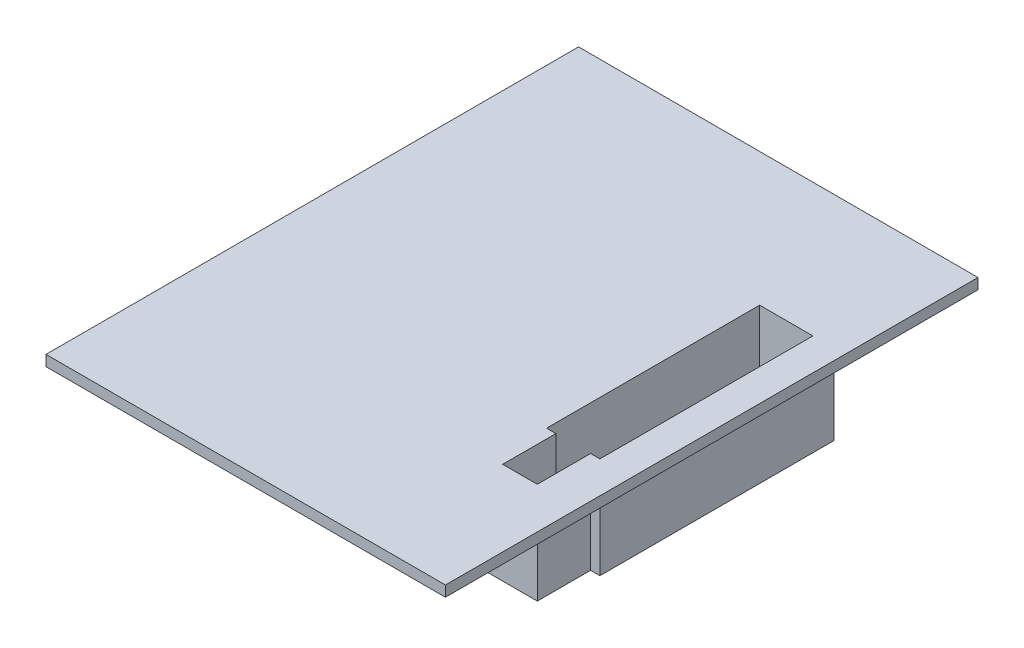
ISO-10303-21;
HEADER;
FILE_DESCRIPTION(('STEP AP214'),'2;1');
FILE_NAME('part.step','',(''),(''),'','','');
FILE_SCHEMA(('AUTOMOTIVE_DESIGN { 1 0 10303 214 1 1 1 1 }'));
ENDSEC;
DATA;
#1=APPLICATION_CONTEXT('core data for automotive mechanical design processes');
#2=APPLICATION_PROTOCOL_DEFINITION('international standard','automotive_design',2000,#1);
#3=PRODUCT_CONTEXT('',#1,'mechanical');
#4=PRODUCT('Part','Part','',(#3));
#5=PRODUCT_RELATED_PRODUCT_CATEGORY('part','',(#4));
#6=PRODUCT_DEFINITION_FORMATION('','',#4);
#7=PRODUCT_DEFINITION_CONTEXT('part definition',#1,'design');
#8=PRODUCT_DEFINITION('design','',#6,#7);
#9=PRODUCT_DEFINITION_SHAPE('','',#8);
#10=(LENGTH_UNIT() NAMED_UNIT(*) SI_UNIT(.MILLI.,.METRE.));
#11=(NAMED_UNIT(*) PLANE_ANGLE_UNIT() SI_UNIT($,.RADIAN.));
#12=(NAMED_UNIT(*) SI_UNIT($,.STERADIAN.) SOLID_ANGLE_UNIT());
#13=UNCERTAINTY_MEASURE_WITH_UNIT(LENGTH_MEASURE(1.E-05),#10,'distance_accuracy_value','');
#14=(GEOMETRIC_REPRESENTATION_CONTEXT(3) GLOBAL_UNCERTAINTY_ASSIGNED_CONTEXT((#13)) GLOBAL_UNIT_ASSIGNED_CONTEXT((#10,
#11,#12)) REPRESENTATION_CONTEXT('',''));
#15=CARTESIAN_POINT('',(0.,0.,0.));
#16=DIRECTION('',(0.,0.,1.));
#17=DIRECTION('',(1.,0.,0.));
#18=AXIS2_PLACEMENT_3D('',#15,#16,#17);
#19=CARTESIAN_POINT('',(0.,0.,0.));
#20=DIRECTION('',(0.,-1.,0.));
#21=DIRECTION('',(0.,0.,-1.));
#22=AXIS2_PLACEMENT_3D('',#19,#20,#21);
#23=PLANE('',#22);
#24=DIRECTION('',(0.,0.,-1.));
#25=VECTOR('',#24,1.);
#26=CARTESIAN_POINT('',(37.5,0.,50.));
#27=LINE('',#26,#25);
#28=CARTESIAN_POINT('',(37.5,0.,50.));
#29=VERTEX_POINT('',#28);
#30=CARTESIAN_POINT('',(37.5,0.,-50.));
#31=VERTEX_POINT('',#30);
#32=EDGE_CURVE('E316',#29,#31,#27,.T.);
#33=ORIENTED_EDGE('',*,*,#32,.F.);
#34=DIRECTION('',(1.,0.,0.));
#35=VECTOR('',#34,1.);
#36=CARTESIAN_POINT('',(-37.5,0.,50.));
#37=LINE('',#36,#35);
#38=CARTESIAN_POINT('',(-37.5,0.,50.));
#39=VERTEX_POINT('',#38);
#40=EDGE_CURVE('E85',#39,#29,#37,.T.);
#41=ORIENTED_EDGE('',*,*,#40,.F.);
#42=DIRECTION('',(0.,0.,1.));
#43=VECTOR('',#42,1.);
#44=CARTESIAN_POINT('',(-37.5,0.,50.));
#45=LINE('',#44,#43);
#46=CARTESIAN_POINT('',(-37.5,0.,-50.));
#47=VERTEX_POINT('',#46);
#48=EDGE_CURVE('E330',#47,#39,#45,.T.);
#49=ORIENTED_EDGE('',*,*,#48,.F.);
#50=DIRECTION('',(-1.,0.,0.));
#51=VECTOR('',#50,1.);
#52=CARTESIAN_POINT('',(-37.5,0.,-50.));
#53=LINE('',#52,#51);
#54=EDGE_CURVE('E328',#31,#47,#53,.T.);
#55=ORIENTED_EDGE('',*,*,#54,.F.);
#56=EDGE_LOOP('',(#33,#41,#49,#55));
#57=FACE_BOUND('',#56,.T.);
#58=DIRECTION('',(-1.,0.,0.));
#59=VECTOR('',#58,1.);
#60=CARTESIAN_POINT('',(33.5,0.,17.));
#61=LINE('',#60,#59);
#62=CARTESIAN_POINT('',(33.5,0.,17.));
#63=VERTEX_POINT('',#62);
#64=CARTESIAN_POINT('',(31.75,0.,17.));
#65=VERTEX_POINT('',#64);
#66=EDGE_CURVE('E254',#63,#65,#61,.T.);
#67=ORIENTED_EDGE('',*,*,#66,.F.);
#68=DIRECTION('',(0.,0.,1.));
#69=VECTOR('',#68,1.);
#70=CARTESIAN_POINT('',(33.5,0.,-27.));
#71=LINE('',#70,#69);
#72=CARTESIAN_POINT('',(33.5,0.,-27.));
#73=VERTEX_POINT('',#72);
#74=EDGE_CURVE('E232',#73,#63,#71,.T.);
#75=ORIENTED_EDGE('',*,*,#74,.F.);
#76=DIRECTION('',(1.,0.,0.));
#77=VECTOR('',#76,1.);
#78=CARTESIAN_POINT('',(19.5,0.,-27.));
#79=LINE('',#78,#77);
#80=CARTESIAN_POINT('',(19.5,0.,-27.));
#81=VERTEX_POINT('',#80);
#82=EDGE_CURVE('E237',#81,#73,#79,.T.);
#83=ORIENTED_EDGE('',*,*,#82,.F.);
#84=DIRECTION('',(0.,0.,-1.));
#85=VECTOR('',#84,1.);
#86=CARTESIAN_POINT('',(19.5,0.,17.));
#87=LINE('',#86,#85);
#88=CARTESIAN_POINT('',(19.5,0.,17.));
#89=VERTEX_POINT('',#88);
#90=EDGE_CURVE('E264',#89,#81,#87,.T.);
#91=ORIENTED_EDGE('',*,*,#90,.F.);
#92=DIRECTION('',(-1.,0.,0.));
#93=VECTOR('',#92,1.);
#94=CARTESIAN_POINT('',(21.25,0.,17.));
#95=LINE('',#94,#93);
#96=CARTESIAN_POINT('',(21.25,0.,17.));
#97=VERTEX_POINT('',#96);
#98=EDGE_CURVE('E262',#97,#89,#95,.T.);
#99=ORIENTED_EDGE('',*,*,#98,.F.);
#100=DIRECTION('',(0.,0.,-1.));
#101=VECTOR('',#100,1.);
#102=CARTESIAN_POINT('',(21.25,0.,27.));
#103=LINE('',#102,#101);
#104=CARTESIAN_POINT('',(21.25,0.,27.));
#105=VERTEX_POINT('',#104);
#106=EDGE_CURVE('E260',#105,#97,#103,.T.);
#107=ORIENTED_EDGE('',*,*,#106,.F.);
#108=DIRECTION('',(-1.,0.,0.));
#109=VECTOR('',#108,1.);
#110=CARTESIAN_POINT('',(31.75,0.,27.));
#111=LINE('',#110,#109);
#112=CARTESIAN_POINT('',(31.75,0.,27.));
#113=VERTEX_POINT('',#112);
#114=EDGE_CURVE('E258',#113,#105,#111,.T.);
#115=ORIENTED_EDGE('',*,*,#114,.F.);
#116=DIRECTION('',(0.,0.,1.));
#117=VECTOR('',#116,1.);
#118=CARTESIAN_POINT('',(31.75,0.,17.));
#119=LINE('',#118,#117);
#120=EDGE_CURVE('E256',#65,#113,#119,.T.);
#121=ORIENTED_EDGE('',*,*,#120,.F.);
#122=EDGE_LOOP('',(#67,#75,#83,#91,#99,#107,#115,#121));
#123=FACE_BOUND('',#122,.T.);
#124=ADVANCED_FACE('F39',(#57,#123),#23,.T.);
#125=CARTESIAN_POINT('',(37.5,2.,50.));
#126=DIRECTION('',(-1.,0.,0.));
#127=DIRECTION('',(0.,0.,1.));
#128=AXIS2_PLACEMENT_3D('',#125,#126,#127);
#129=PLANE('',#128);
#130=ORIENTED_EDGE('',*,*,#32,.T.);
#131=DIRECTION('',(0.,-1.,0.));
#132=VECTOR('',#131,1.);
#133=CARTESIAN_POINT('',(37.5,2.,-50.));
#134=LINE('',#133,#132);
#135=CARTESIAN_POINT('',(37.5,2.,-50.));
#136=VERTEX_POINT('',#135);
#137=EDGE_CURVE('E11',#136,#31,#134,.T.);
#138=ORIENTED_EDGE('',*,*,#137,.F.);
#139=DIRECTION('',(0.,0.,-1.));
#140=VECTOR('',#139,1.);
#141=CARTESIAN_POINT('',(37.5,2.,50.));
#142=LINE('',#141,#140);
#143=CARTESIAN_POINT('',(37.5,2.,50.));
#144=VERTEX_POINT('',#143);
#145=EDGE_CURVE('E319',#144,#136,#142,.T.);
#146=ORIENTED_EDGE('',*,*,#145,.F.);
#147=DIRECTION('',(0.,-1.,0.));
#148=VECTOR('',#147,1.);
#149=CARTESIAN_POINT('',(37.5,2.,50.));
#150=LINE('',#149,#148);
#151=EDGE_CURVE('E325',#144,#29,#150,.T.);
#152=ORIENTED_EDGE('',*,*,#151,.T.);
#153=EDGE_LOOP('',(#130,#138,#146,#152));
#154=FACE_BOUND('',#153,.T.);
#155=ADVANCED_FACE('F41',(#154),#129,.F.);
#156=CARTESIAN_POINT('',(-37.5,2.,-50.));
#157=DIRECTION('',(0.,0.,1.));
#158=DIRECTION('',(1.,0.,0.));
#159=AXIS2_PLACEMENT_3D('',#156,#157,#158);
#160=PLANE('',#159);
#161=ORIENTED_EDGE('',*,*,#54,.T.);
#162=DIRECTION('',(0.,-1.,0.));
#163=VECTOR('',#162,1.);
#164=CARTESIAN_POINT('',(-37.5,2.,-50.));
#165=LINE('',#164,#163);
#166=CARTESIAN_POINT('',(-37.5,2.,-50.));
#167=VERTEX_POINT('',#166);
#168=EDGE_CURVE('E48',#167,#47,#165,.T.);
#169=ORIENTED_EDGE('',*,*,#168,.F.);
#170=DIRECTION('',(-1.,0.,0.));
#171=VECTOR('',#170,1.);
#172=CARTESIAN_POINT('',(-37.5,2.,-50.));
#173=LINE('',#172,#171);
#174=EDGE_CURVE('E92',#136,#167,#173,.T.);
#175=ORIENTED_EDGE('',*,*,#174,.F.);
#176=ORIENTED_EDGE('',*,*,#137,.T.);
#177=EDGE_LOOP('',(#161,#169,#175,#176));
#178=FACE_BOUND('',#177,.T.);
#179=ADVANCED_FACE('F359',(#178),#160,.F.);
#180=CARTESIAN_POINT('',(-37.5,2.,50.));
#181=DIRECTION('',(1.,0.,0.));
#182=DIRECTION('',(0.,0.,-1.));
#183=AXIS2_PLACEMENT_3D('',#180,#181,#182);
#184=PLANE('',#183);
#185=ORIENTED_EDGE('',*,*,#48,.T.);
#186=DIRECTION('',(0.,-1.,0.));
#187=VECTOR('',#186,1.);
#188=CARTESIAN_POINT('',(-37.5,2.,50.));
#189=LINE('',#188,#187);
#190=CARTESIAN_POINT('',(-37.5,2.,50.));
#191=VERTEX_POINT('',#190);
#192=EDGE_CURVE('E334',#191,#39,#189,.T.);
#193=ORIENTED_EDGE('',*,*,#192,.F.);
#194=DIRECTION('',(0.,0.,1.));
#195=VECTOR('',#194,1.);
#196=CARTESIAN_POINT('',(-37.5,2.,50.));
#197=LINE('',#196,#195);
#198=EDGE_CURVE('E322',#167,#191,#197,.T.);
#199=ORIENTED_EDGE('',*,*,#198,.F.);
#200=ORIENTED_EDGE('',*,*,#168,.T.);
#201=EDGE_LOOP('',(#185,#193,#199,#200));
#202=FACE_BOUND('',#201,.T.);
#203=ADVANCED_FACE('F340',(#202),#184,.F.);
#204=CARTESIAN_POINT('',(-37.5,2.,50.));
#205=DIRECTION('',(0.,0.,-1.));
#206=DIRECTION('',(-1.,0.,0.));
#207=AXIS2_PLACEMENT_3D('',#204,#205,#206);
#208=PLANE('',#207);
#209=ORIENTED_EDGE('',*,*,#40,.T.);
#210=ORIENTED_EDGE('',*,*,#151,.F.);
#211=DIRECTION('',(1.,0.,0.));
#212=VECTOR('',#211,1.);
#213=CARTESIAN_POINT('',(-37.5,2.,50.));
#214=LINE('',#213,#212);
#215=EDGE_CURVE('E64',#191,#144,#214,.T.);
#216=ORIENTED_EDGE('',*,*,#215,.F.);
#217=ORIENTED_EDGE('',*,*,#192,.T.);
#218=EDGE_LOOP('',(#209,#210,#216,#217));
#219=FACE_BOUND('',#218,.T.);
#220=ADVANCED_FACE('F348',(#219),#208,.F.);
#221=CARTESIAN_POINT('',(0.,2.,0.));
#222=DIRECTION('',(0.,-1.,0.));
#223=DIRECTION('',(0.,0.,-1.));
#224=AXIS2_PLACEMENT_3D('',#221,#222,#223);
#225=PLANE('',#224);
#226=DIRECTION('',(0.,0.,-1.));
#227=VECTOR('',#226,1.);
#228=CARTESIAN_POINT('',(31.5,2.,-25.));
#229=LINE('',#228,#227);
#230=CARTESIAN_POINT('',(31.5,2.,15.));
#231=VERTEX_POINT('',#230);
#232=CARTESIAN_POINT('',(31.5,2.,-25.));
#233=VERTEX_POINT('',#232);
#234=EDGE_CURVE('E308',#231,#233,#229,.T.);
#235=ORIENTED_EDGE('',*,*,#234,.F.);
#236=DIRECTION('',(1.,0.,0.));
#237=VECTOR('',#236,1.);
#238=CARTESIAN_POINT('',(31.5,2.,15.));
#239=LINE('',#238,#237);
#240=CARTESIAN_POINT('',(29.75,2.,15.));
#241=VERTEX_POINT('',#240);
#242=EDGE_CURVE('E199',#241,#231,#239,.T.);
#243=ORIENTED_EDGE('',*,*,#242,.F.);
#244=DIRECTION('',(0.,0.,-1.));
#245=VECTOR('',#244,1.);
#246=CARTESIAN_POINT('',(29.75,2.,25.));
#247=LINE('',#246,#245);
#248=CARTESIAN_POINT('',(29.75,2.,25.));
#249=VERTEX_POINT('',#248);
#250=EDGE_CURVE('E291',#249,#241,#247,.T.);
#251=ORIENTED_EDGE('',*,*,#250,.F.);
#252=DIRECTION('',(1.,0.,0.));
#253=VECTOR('',#252,1.);
#254=CARTESIAN_POINT('',(21.5,2.,25.));
#255=LINE('',#254,#253);
#256=CARTESIAN_POINT('',(23.25,2.,25.));
#257=VERTEX_POINT('',#256);
#258=EDGE_CURVE('E195',#257,#249,#255,.T.);
#259=ORIENTED_EDGE('',*,*,#258,.F.);
#260=DIRECTION('',(0.,0.,1.));
#261=VECTOR('',#260,1.);
#262=CARTESIAN_POINT('',(23.25,2.,25.));
#263=LINE('',#262,#261);
#264=CARTESIAN_POINT('',(23.25,2.,15.));
#265=VERTEX_POINT('',#264);
#266=EDGE_CURVE('E296',#265,#257,#263,.T.);
#267=ORIENTED_EDGE('',*,*,#266,.F.);
#268=DIRECTION('',(1.,0.,0.));
#269=VECTOR('',#268,1.);
#270=CARTESIAN_POINT('',(21.5,2.,15.));
#271=LINE('',#270,#269);
#272=CARTESIAN_POINT('',(21.5,2.,15.));
#273=VERTEX_POINT('',#272);
#274=EDGE_CURVE('E293',#273,#265,#271,.T.);
#275=ORIENTED_EDGE('',*,*,#274,.F.);
#276=DIRECTION('',(0.,0.,1.));
#277=VECTOR('',#276,1.);
#278=CARTESIAN_POINT('',(21.5,2.,-25.));
#279=LINE('',#278,#277);
#280=CARTESIAN_POINT('',(21.5,2.,-25.));
#281=VERTEX_POINT('',#280);
#282=EDGE_CURVE('E301',#281,#273,#279,.T.);
#283=ORIENTED_EDGE('',*,*,#282,.F.);
#284=DIRECTION('',(-1.,0.,0.));
#285=VECTOR('',#284,1.);
#286=CARTESIAN_POINT('',(21.5,2.,-25.));
#287=LINE('',#286,#285);
#288=EDGE_CURVE('E310',#233,#281,#287,.T.);
#289=ORIENTED_EDGE('',*,*,#288,.F.);
#290=EDGE_LOOP('',(#235,#243,#251,#259,#267,#275,#283,#289));
#291=FACE_BOUND('',#290,.T.);
#292=ORIENTED_EDGE('',*,*,#145,.T.);
#293=ORIENTED_EDGE('',*,*,#174,.T.);
#294=ORIENTED_EDGE('',*,*,#198,.T.);
#295=ORIENTED_EDGE('',*,*,#215,.T.);
#296=EDGE_LOOP('',(#292,#293,#294,#295));
#297=FACE_BOUND('',#296,.T.);
#298=ADVANCED_FACE('F350',(#291,#297),#225,.F.);
#299=CARTESIAN_POINT('',(21.5,-0.00100000000000013,-25.));
#300=DIRECTION('',(-1.,0.,0.));
#301=DIRECTION('',(0.,0.,1.));
#302=AXIS2_PLACEMENT_3D('',#299,#300,#301);
#303=PLANE('',#302);
#304=ORIENTED_EDGE('',*,*,#282,.T.);
#305=DIRECTION('',(0.,-1.,0.));
#306=VECTOR('',#305,1.);
#307=CARTESIAN_POINT('',(21.5,2.,15.));
#308=LINE('',#307,#306);
#309=CARTESIAN_POINT('',(21.5,-15.,15.));
#310=VERTEX_POINT('',#309);
#311=EDGE_CURVE('E298',#273,#310,#308,.T.);
#312=ORIENTED_EDGE('',*,*,#311,.T.);
#313=DIRECTION('',(0.,0.,-1.));
#314=VECTOR('',#313,1.);
#315=CARTESIAN_POINT('',(21.5,-15.,15.));
#316=LINE('',#315,#314);
#317=CARTESIAN_POINT('',(21.5,-15.,-25.));
#318=VERTEX_POINT('',#317);
#319=EDGE_CURVE('E221',#310,#318,#316,.T.);
#320=ORIENTED_EDGE('',*,*,#319,.T.);
#321=DIRECTION('',(0.,1.,0.));
#322=VECTOR('',#321,1.);
#323=CARTESIAN_POINT('',(21.5,-0.00100000000000013,-25.));
#324=LINE('',#323,#322);
#325=EDGE_CURVE('E314',#318,#281,#324,.T.);
#326=ORIENTED_EDGE('',*,*,#325,.T.);
#327=EDGE_LOOP('',(#304,#312,#320,#326));
#328=FACE_BOUND('',#327,.T.);
#329=ADVANCED_FACE('F356',(#328),#303,.F.);
#330=CARTESIAN_POINT('',(21.5,-0.00100000000000013,-25.));
#331=DIRECTION('',(0.,0.,-1.));
#332=DIRECTION('',(-1.,0.,0.));
#333=AXIS2_PLACEMENT_3D('',#330,#331,#332);
#334=PLANE('',#333);
#335=DIRECTION('',(0.,1.,0.));
#336=VECTOR('',#335,1.);
#337=CARTESIAN_POINT('',(31.5,-0.00100000000000013,-25.));
#338=LINE('',#337,#336);
#339=CARTESIAN_POINT('',(31.5,-15.,-25.));
#340=VERTEX_POINT('',#339);
#341=EDGE_CURVE('E313',#340,#233,#338,.T.);
#342=ORIENTED_EDGE('',*,*,#341,.T.);
#343=ORIENTED_EDGE('',*,*,#288,.T.);
#344=ORIENTED_EDGE('',*,*,#325,.F.);
#345=DIRECTION('',(1.,0.,0.));
#346=VECTOR('',#345,1.);
#347=CARTESIAN_POINT('',(21.5,-15.,-25.));
#348=LINE('',#347,#346);
#349=EDGE_CURVE('E224',#318,#340,#348,.T.);
#350=ORIENTED_EDGE('',*,*,#349,.T.);
#351=EDGE_LOOP('',(#342,#343,#344,#350));
#352=FACE_BOUND('',#351,.T.);
#353=ADVANCED_FACE('F369',(#352),#334,.F.);
#354=CARTESIAN_POINT('',(31.5,-0.00100000000000013,-25.));
#355=DIRECTION('',(1.,0.,0.));
#356=DIRECTION('',(0.,0.,-1.));
#357=AXIS2_PLACEMENT_3D('',#354,#355,#356);
#358=PLANE('',#357);
#359=ORIENTED_EDGE('',*,*,#341,.F.);
#360=DIRECTION('',(0.,0.,1.));
#361=VECTOR('',#360,1.);
#362=CARTESIAN_POINT('',(31.5,-15.,-25.));
#363=LINE('',#362,#361);
#364=CARTESIAN_POINT('',(31.5,-15.,15.));
#365=VERTEX_POINT('',#364);
#366=EDGE_CURVE('E227',#340,#365,#363,.T.);
#367=ORIENTED_EDGE('',*,*,#366,.T.);
#368=DIRECTION('',(0.,-1.,0.));
#369=VECTOR('',#368,1.);
#370=CARTESIAN_POINT('',(31.5,2.,15.));
#371=LINE('',#370,#369);
#372=EDGE_CURVE('E286',#231,#365,#371,.T.);
#373=ORIENTED_EDGE('',*,*,#372,.F.);
#374=ORIENTED_EDGE('',*,*,#234,.T.);
#375=EDGE_LOOP('',(#359,#367,#373,#374));
#376=FACE_BOUND('',#375,.T.);
#377=ADVANCED_FACE('F374',(#376),#358,.F.);
#378=CARTESIAN_POINT('',(21.5,-0.00100000000000013,25.));
#379=DIRECTION('',(0.,0.,1.));
#380=DIRECTION('',(1.,0.,0.));
#381=AXIS2_PLACEMENT_3D('',#378,#379,#380);
#382=PLANE('',#381);
#383=ORIENTED_EDGE('',*,*,#258,.T.);
#384=DIRECTION('',(0.,-1.,0.));
#385=VECTOR('',#384,1.);
#386=CARTESIAN_POINT('',(29.75,2.,25.));
#387=LINE('',#386,#385);
#388=CARTESIAN_POINT('',(29.75,-15.,25.));
#389=VERTEX_POINT('',#388);
#390=EDGE_CURVE('E187',#249,#389,#387,.T.);
#391=ORIENTED_EDGE('',*,*,#390,.T.);
#392=DIRECTION('',(-1.,0.,0.));
#393=VECTOR('',#392,1.);
#394=CARTESIAN_POINT('',(29.75,-15.,25.));
#395=LINE('',#394,#393);
#396=CARTESIAN_POINT('',(23.25,-15.,25.));
#397=VERTEX_POINT('',#396);
#398=EDGE_CURVE('E192',#389,#397,#395,.T.);
#399=ORIENTED_EDGE('',*,*,#398,.T.);
#400=DIRECTION('',(0.,-1.,0.));
#401=VECTOR('',#400,1.);
#402=CARTESIAN_POINT('',(23.25,2.,25.));
#403=LINE('',#402,#401);
#404=EDGE_CURVE('E299',#257,#397,#403,.T.);
#405=ORIENTED_EDGE('',*,*,#404,.F.);
#406=EDGE_LOOP('',(#383,#391,#399,#405));
#407=FACE_BOUND('',#406,.T.);
#408=ADVANCED_FACE('F189',(#407),#382,.F.);
#409=CARTESIAN_POINT('',(23.25,2.,25.));
#410=DIRECTION('',(1.,0.,0.));
#411=DIRECTION('',(0.,0.,-1.));
#412=AXIS2_PLACEMENT_3D('',#409,#410,#411);
#413=PLANE('',#412);
#414=CARTESIAN_POINT('',(23.25,-3.5,22.));
#415=DIRECTION('',(1.,0.,0.));
#416=DIRECTION('',(0.,0.,-1.));
#417=AXIS2_PLACEMENT_3D('',#414,#415,#416);
#418=CIRCLE('',#417,1.75);
#419=CARTESIAN_POINT('',(23.25,-3.5,20.25));
#420=VERTEX_POINT('',#419);
#421=EDGE_CURVE('E208',#420,#420,#418,.T.);
#422=ORIENTED_EDGE('',*,*,#421,.F.);
#423=EDGE_LOOP('',(#422));
#424=FACE_BOUND('',#423,.T.);
#425=ORIENTED_EDGE('',*,*,#404,.T.);
#426=DIRECTION('',(0.,0.,-1.));
#427=VECTOR('',#426,1.);
#428=CARTESIAN_POINT('',(23.25,-15.,25.));
#429=LINE('',#428,#427);
#430=CARTESIAN_POINT('',(23.25,-15.,15.));
#431=VERTEX_POINT('',#430);
#432=EDGE_CURVE('E213',#397,#431,#429,.T.);
#433=ORIENTED_EDGE('',*,*,#432,.T.);
#434=DIRECTION('',(0.,-1.,0.));
#435=VECTOR('',#434,1.);
#436=CARTESIAN_POINT('',(23.25,2.,15.));
#437=LINE('',#436,#435);
#438=EDGE_CURVE('E302',#265,#431,#437,.T.);
#439=ORIENTED_EDGE('',*,*,#438,.F.);
#440=ORIENTED_EDGE('',*,*,#266,.T.);
#441=EDGE_LOOP('',(#425,#433,#439,#440));
#442=FACE_BOUND('',#441,.T.);
#443=ADVANCED_FACE('F373',(#424,#442),#413,.T.);
#444=CARTESIAN_POINT('',(21.5,2.,15.));
#445=DIRECTION('',(0.,0.,-1.));
#446=DIRECTION('',(-1.,0.,0.));
#447=AXIS2_PLACEMENT_3D('',#444,#445,#446);
#448=PLANE('',#447);
#449=ORIENTED_EDGE('',*,*,#438,.T.);
#450=DIRECTION('',(-1.,0.,0.));
#451=VECTOR('',#450,1.);
#452=CARTESIAN_POINT('',(23.25,-15.,15.));
#453=LINE('',#452,#451);
#454=EDGE_CURVE('E215',#431,#310,#453,.T.);
#455=ORIENTED_EDGE('',*,*,#454,.T.);
#456=ORIENTED_EDGE('',*,*,#311,.F.);
#457=ORIENTED_EDGE('',*,*,#274,.T.);
#458=EDGE_LOOP('',(#449,#455,#456,#457));
#459=FACE_BOUND('',#458,.T.);
#460=ADVANCED_FACE('F381',(#459),#448,.T.);
#461=CARTESIAN_POINT('',(31.5,2.,15.));
#462=DIRECTION('',(0.,0.,-1.));
#463=DIRECTION('',(-1.,0.,0.));
#464=AXIS2_PLACEMENT_3D('',#461,#462,#463);
#465=PLANE('',#464);
#466=ORIENTED_EDGE('',*,*,#372,.T.);
#467=DIRECTION('',(-1.,0.,0.));
#468=VECTOR('',#467,1.);
#469=CARTESIAN_POINT('',(31.5,-15.,15.));
#470=LINE('',#469,#468);
#471=CARTESIAN_POINT('',(29.75,-15.,15.));
#472=VERTEX_POINT('',#471);
#473=EDGE_CURVE('E230',#365,#472,#470,.T.);
#474=ORIENTED_EDGE('',*,*,#473,.T.);
#475=DIRECTION('',(0.,-1.,0.));
#476=VECTOR('',#475,1.);
#477=CARTESIAN_POINT('',(29.75,2.,15.));
#478=LINE('',#477,#476);
#479=EDGE_CURVE('E200',#241,#472,#478,.T.);
#480=ORIENTED_EDGE('',*,*,#479,.F.);
#481=ORIENTED_EDGE('',*,*,#242,.T.);
#482=EDGE_LOOP('',(#466,#474,#480,#481));
#483=FACE_BOUND('',#482,.T.);
#484=ADVANCED_FACE('F384',(#483),#465,.T.);
#485=CARTESIAN_POINT('',(29.75,2.,25.));
#486=DIRECTION('',(-1.,0.,0.));
#487=DIRECTION('',(0.,0.,1.));
#488=AXIS2_PLACEMENT_3D('',#485,#486,#487);
#489=PLANE('',#488);
#490=CARTESIAN_POINT('',(29.75,-3.5,22.));
#491=DIRECTION('',(-1.,0.,0.));
#492=DIRECTION('',(0.,0.,1.));
#493=AXIS2_PLACEMENT_3D('',#490,#491,#492);
#494=CIRCLE('',#493,1.75);
#495=CARTESIAN_POINT('',(29.75,-3.5,23.75));
#496=VERTEX_POINT('',#495);
#497=EDGE_CURVE('E444',#496,#496,#494,.T.);
#498=ORIENTED_EDGE('',*,*,#497,.F.);
#499=EDGE_LOOP('',(#498));
#500=FACE_BOUND('',#499,.T.);
#501=ORIENTED_EDGE('',*,*,#479,.T.);
#502=DIRECTION('',(0.,0.,1.));
#503=VECTOR('',#502,1.);
#504=CARTESIAN_POINT('',(29.75,-15.,15.));
#505=LINE('',#504,#503);
#506=EDGE_CURVE('E203',#472,#389,#505,.T.);
#507=ORIENTED_EDGE('',*,*,#506,.T.);
#508=ORIENTED_EDGE('',*,*,#390,.F.);
#509=ORIENTED_EDGE('',*,*,#250,.T.);
#510=EDGE_LOOP('',(#501,#507,#508,#509));
#511=FACE_BOUND('',#510,.T.);
#512=ADVANCED_FACE('F204',(#500,#511),#489,.T.);
#513=CARTESIAN_POINT('',(0.,-15.,0.));
#514=DIRECTION('',(0.,-1.,0.));
#515=DIRECTION('',(0.,0.,-1.));
#516=AXIS2_PLACEMENT_3D('',#513,#514,#515);
#517=PLANE('',#516);
#518=DIRECTION('',(0.,0.,1.));
#519=VECTOR('',#518,1.);
#520=CARTESIAN_POINT('',(33.5,-15.,-27.));
#521=LINE('',#520,#519);
#522=CARTESIAN_POINT('',(33.5,-15.,-27.));
#523=VERTEX_POINT('',#522);
#524=CARTESIAN_POINT('',(33.5,-15.,17.));
#525=VERTEX_POINT('',#524);
#526=EDGE_CURVE('E233',#523,#525,#521,.T.);
#527=ORIENTED_EDGE('',*,*,#526,.T.);
#528=DIRECTION('',(-1.,0.,0.));
#529=VECTOR('',#528,1.);
#530=CARTESIAN_POINT('',(33.5,-15.,17.));
#531=LINE('',#530,#529);
#532=CARTESIAN_POINT('',(31.75,-15.,17.));
#533=VERTEX_POINT('',#532);
#534=EDGE_CURVE('E236',#525,#533,#531,.T.);
#535=ORIENTED_EDGE('',*,*,#534,.T.);
#536=DIRECTION('',(0.,0.,1.));
#537=VECTOR('',#536,1.);
#538=CARTESIAN_POINT('',(31.75,-15.,17.));
#539=LINE('',#538,#537);
#540=CARTESIAN_POINT('',(31.75,-15.,27.));
#541=VERTEX_POINT('',#540);
#542=EDGE_CURVE('E239',#533,#541,#539,.T.);
#543=ORIENTED_EDGE('',*,*,#542,.T.);
#544=DIRECTION('',(-1.,0.,0.));
#545=VECTOR('',#544,1.);
#546=CARTESIAN_POINT('',(31.75,-15.,27.));
#547=LINE('',#546,#545);
#548=CARTESIAN_POINT('',(21.25,-15.,27.));
#549=VERTEX_POINT('',#548);
#550=EDGE_CURVE('E241',#541,#549,#547,.T.);
#551=ORIENTED_EDGE('',*,*,#550,.T.);
#552=DIRECTION('',(0.,0.,-1.));
#553=VECTOR('',#552,1.);
#554=CARTESIAN_POINT('',(21.25,-15.,27.));
#555=LINE('',#554,#553);
#556=CARTESIAN_POINT('',(21.25,-15.,17.));
#557=VERTEX_POINT('',#556);
#558=EDGE_CURVE('E243',#549,#557,#555,.T.);
#559=ORIENTED_EDGE('',*,*,#558,.T.);
#560=DIRECTION('',(-1.,0.,0.));
#561=VECTOR('',#560,1.);
#562=CARTESIAN_POINT('',(21.25,-15.,17.));
#563=LINE('',#562,#561);
#564=CARTESIAN_POINT('',(19.5,-15.,17.));
#565=VERTEX_POINT('',#564);
#566=EDGE_CURVE('E245',#557,#565,#563,.T.);
#567=ORIENTED_EDGE('',*,*,#566,.T.);
#568=DIRECTION('',(0.,0.,-1.));
#569=VECTOR('',#568,1.);
#570=CARTESIAN_POINT('',(19.5,-15.,17.));
#571=LINE('',#570,#569);
#572=CARTESIAN_POINT('',(19.5,-15.,-27.));
#573=VERTEX_POINT('',#572);
#574=EDGE_CURVE('E247',#565,#573,#571,.T.);
#575=ORIENTED_EDGE('',*,*,#574,.T.);
#576=DIRECTION('',(1.,0.,0.));
#577=VECTOR('',#576,1.);
#578=CARTESIAN_POINT('',(19.5,-15.,-27.));
#579=LINE('',#578,#577);
#580=EDGE_CURVE('E249',#573,#523,#579,.T.);
#581=ORIENTED_EDGE('',*,*,#580,.T.);
#582=EDGE_LOOP('',(#527,#535,#543,#551,#559,#567,#575,#581));
#583=FACE_BOUND('',#582,.T.);
#584=ORIENTED_EDGE('',*,*,#398,.F.);
#585=ORIENTED_EDGE('',*,*,#506,.F.);
#586=ORIENTED_EDGE('',*,*,#473,.F.);
#587=ORIENTED_EDGE('',*,*,#366,.F.);
#588=ORIENTED_EDGE('',*,*,#349,.F.);
#589=ORIENTED_EDGE('',*,*,#319,.F.);
#590=ORIENTED_EDGE('',*,*,#454,.F.);
#591=ORIENTED_EDGE('',*,*,#432,.F.);
#592=EDGE_LOOP('',(#584,#585,#586,#587,#588,#589,#590,#591));
#593=FACE_BOUND('',#592,.T.);
#594=ADVANCED_FACE('F210',(#583,#593),#517,.T.);
#595=CARTESIAN_POINT('',(33.5,-15.,-27.));
#596=DIRECTION('',(-1.,0.,0.));
#597=DIRECTION('',(0.,0.,1.));
#598=AXIS2_PLACEMENT_3D('',#595,#596,#597);
#599=PLANE('',#598);
#600=ORIENTED_EDGE('',*,*,#74,.T.);
#601=DIRECTION('',(0.,1.,0.));
#602=VECTOR('',#601,1.);
#603=CARTESIAN_POINT('',(33.5,-15.,17.));
#604=LINE('',#603,#602);
#605=EDGE_CURVE('E285',#525,#63,#604,.T.);
#606=ORIENTED_EDGE('',*,*,#605,.F.);
#607=ORIENTED_EDGE('',*,*,#526,.F.);
#608=DIRECTION('',(0.,1.,0.));
#609=VECTOR('',#608,1.);
#610=CARTESIAN_POINT('',(33.5,-15.,-27.));
#611=LINE('',#610,#609);
#612=EDGE_CURVE('E251',#523,#73,#611,.T.);
#613=ORIENTED_EDGE('',*,*,#612,.T.);
#614=EDGE_LOOP('',(#600,#606,#607,#613));
#615=FACE_BOUND('',#614,.T.);
#616=ADVANCED_FACE('F395',(#615),#599,.F.);
#617=CARTESIAN_POINT('',(33.5,-15.,17.));
#618=DIRECTION('',(0.,0.,-1.));
#619=DIRECTION('',(-1.,0.,0.));
#620=AXIS2_PLACEMENT_3D('',#617,#618,#619);
#621=PLANE('',#620);
#622=ORIENTED_EDGE('',*,*,#66,.T.);
#623=DIRECTION('',(0.,1.,0.));
#624=VECTOR('',#623,1.);
#625=CARTESIAN_POINT('',(31.75,-15.,17.));
#626=LINE('',#625,#624);
#627=EDGE_CURVE('E282',#533,#65,#626,.T.);
#628=ORIENTED_EDGE('',*,*,#627,.F.);
#629=ORIENTED_EDGE('',*,*,#534,.F.);
#630=ORIENTED_EDGE('',*,*,#605,.T.);
#631=EDGE_LOOP('',(#622,#628,#629,#630));
#632=FACE_BOUND('',#631,.T.);
#633=ADVANCED_FACE('F398',(#632),#621,.F.);
#634=CARTESIAN_POINT('',(31.75,-15.,17.));
#635=DIRECTION('',(-1.,0.,0.));
#636=DIRECTION('',(0.,0.,1.));
#637=AXIS2_PLACEMENT_3D('',#634,#635,#636);
#638=PLANE('',#637);
#639=CARTESIAN_POINT('',(31.75,-3.5,22.));
#640=DIRECTION('',(-1.,0.,0.));
#641=DIRECTION('',(0.,0.,1.));
#642=AXIS2_PLACEMENT_3D('',#639,#640,#641);
#643=CIRCLE('',#642,1.75);
#644=CARTESIAN_POINT('',(31.75,-3.5,23.75));
#645=VERTEX_POINT('',#644);
#646=EDGE_CURVE('E442',#645,#645,#643,.T.);
#647=ORIENTED_EDGE('',*,*,#646,.T.);
#648=EDGE_LOOP('',(#647));
#649=FACE_BOUND('',#648,.T.);
#650=ORIENTED_EDGE('',*,*,#120,.T.);
#651=DIRECTION('',(0.,1.,0.));
#652=VECTOR('',#651,1.);
#653=CARTESIAN_POINT('',(31.75,-15.,27.));
#654=LINE('',#653,#652);
#655=EDGE_CURVE('E279',#541,#113,#654,.T.);
#656=ORIENTED_EDGE('',*,*,#655,.F.);
#657=ORIENTED_EDGE('',*,*,#542,.F.);
#658=ORIENTED_EDGE('',*,*,#627,.T.);
#659=EDGE_LOOP('',(#650,#656,#657,#658));
#660=FACE_BOUND('',#659,.T.);
#661=ADVANCED_FACE('F402',(#649,#660),#638,.F.);
#662=CARTESIAN_POINT('',(31.75,-15.,27.));
#663=DIRECTION('',(0.,0.,-1.));
#664=DIRECTION('',(-1.,0.,0.));
#665=AXIS2_PLACEMENT_3D('',#662,#663,#664);
#666=PLANE('',#665);
#667=ORIENTED_EDGE('',*,*,#114,.T.);
#668=DIRECTION('',(0.,1.,0.));
#669=VECTOR('',#668,1.);
#670=CARTESIAN_POINT('',(21.25,-15.,27.));
#671=LINE('',#670,#669);
#672=EDGE_CURVE('E276',#549,#105,#671,.T.);
#673=ORIENTED_EDGE('',*,*,#672,.F.);
#674=ORIENTED_EDGE('',*,*,#550,.F.);
#675=ORIENTED_EDGE('',*,*,#655,.T.);
#676=EDGE_LOOP('',(#667,#673,#674,#675));
#677=FACE_BOUND('',#676,.T.);
#678=ADVANCED_FACE('F406',(#677),#666,.F.);
#679=CARTESIAN_POINT('',(21.25,-15.,27.));
#680=DIRECTION('',(1.,0.,0.));
#681=DIRECTION('',(0.,0.,-1.));
#682=AXIS2_PLACEMENT_3D('',#679,#680,#681);
#683=PLANE('',#682);
#684=CARTESIAN_POINT('',(21.25,-3.5,22.));
#685=DIRECTION('',(1.,0.,0.));
#686=DIRECTION('',(0.,0.,-1.));
#687=AXIS2_PLACEMENT_3D('',#684,#685,#686);
#688=CIRCLE('',#687,1.75);
#689=CARTESIAN_POINT('',(21.25,-3.5,20.25));
#690=VERTEX_POINT('',#689);
#691=EDGE_CURVE('E43',#690,#690,#688,.T.);
#692=ORIENTED_EDGE('',*,*,#691,.T.);
#693=EDGE_LOOP('',(#692));
#694=FACE_BOUND('',#693,.T.);
#695=ORIENTED_EDGE('',*,*,#106,.T.);
#696=DIRECTION('',(0.,1.,0.));
#697=VECTOR('',#696,1.);
#698=CARTESIAN_POINT('',(21.25,-15.,17.));
#699=LINE('',#698,#697);
#700=EDGE_CURVE('E273',#557,#97,#699,.T.);
#701=ORIENTED_EDGE('',*,*,#700,.F.);
#702=ORIENTED_EDGE('',*,*,#558,.F.);
#703=ORIENTED_EDGE('',*,*,#672,.T.);
#704=EDGE_LOOP('',(#695,#701,#702,#703));
#705=FACE_BOUND('',#704,.T.);
#706=ADVANCED_FACE('F410',(#694,#705),#683,.F.);
#707=CARTESIAN_POINT('',(21.25,-15.,17.));
#708=DIRECTION('',(0.,0.,-1.));
#709=DIRECTION('',(-1.,0.,0.));
#710=AXIS2_PLACEMENT_3D('',#707,#708,#709);
#711=PLANE('',#710);
#712=ORIENTED_EDGE('',*,*,#98,.T.);
#713=DIRECTION('',(0.,1.,0.));
#714=VECTOR('',#713,1.);
#715=CARTESIAN_POINT('',(19.5,-15.,17.));
#716=LINE('',#715,#714);
#717=EDGE_CURVE('E270',#565,#89,#716,.T.);
#718=ORIENTED_EDGE('',*,*,#717,.F.);
#719=ORIENTED_EDGE('',*,*,#566,.F.);
#720=ORIENTED_EDGE('',*,*,#700,.T.);
#721=EDGE_LOOP('',(#712,#718,#719,#720));
#722=FACE_BOUND('',#721,.T.);
#723=ADVANCED_FACE('F414',(#722),#711,.F.);
#724=CARTESIAN_POINT('',(19.5,-15.,17.));
#725=DIRECTION('',(1.,0.,0.));
#726=DIRECTION('',(0.,0.,-1.));
#727=AXIS2_PLACEMENT_3D('',#724,#725,#726);
#728=PLANE('',#727);
#729=ORIENTED_EDGE('',*,*,#90,.T.);
#730=DIRECTION('',(0.,1.,0.));
#731=VECTOR('',#730,1.);
#732=CARTESIAN_POINT('',(19.5,-15.,-27.));
#733=LINE('',#732,#731);
#734=EDGE_CURVE('E55',#573,#81,#733,.T.);
#735=ORIENTED_EDGE('',*,*,#734,.F.);
#736=ORIENTED_EDGE('',*,*,#574,.F.);
#737=ORIENTED_EDGE('',*,*,#717,.T.);
#738=EDGE_LOOP('',(#729,#735,#736,#737));
#739=FACE_BOUND('',#738,.T.);
#740=ADVANCED_FACE('F418',(#739),#728,.F.);
#741=CARTESIAN_POINT('',(19.5,-15.,-27.));
#742=DIRECTION('',(0.,0.,1.));
#743=DIRECTION('',(1.,0.,0.));
#744=AXIS2_PLACEMENT_3D('',#741,#742,#743);
#745=PLANE('',#744);
#746=ORIENTED_EDGE('',*,*,#82,.T.);
#747=ORIENTED_EDGE('',*,*,#612,.F.);
#748=ORIENTED_EDGE('',*,*,#580,.F.);
#749=ORIENTED_EDGE('',*,*,#734,.T.);
#750=EDGE_LOOP('',(#746,#747,#748,#749));
#751=FACE_BOUND('',#750,.T.);
#752=ADVANCED_FACE('F422',(#751),#745,.F.);
#753=CARTESIAN_POINT('',(37.5,-3.5,22.));
#754=DIRECTION('',(-1.,0.,0.));
#755=DIRECTION('',(0.,0.,1.));
#756=AXIS2_PLACEMENT_3D('',#753,#754,#755);
#757=CYLINDRICAL_SURFACE('',#756,1.75);
#758=ORIENTED_EDGE('',*,*,#421,.T.);
#759=EDGE_LOOP('',(#758));
#760=FACE_BOUND('',#759,.T.);
#761=ORIENTED_EDGE('',*,*,#691,.F.);
#762=EDGE_LOOP('',(#761));
#763=FACE_BOUND('',#762,.T.);
#764=ADVANCED_FACE('F426',(#760,#763),#757,.F.);
#765=ORIENTED_EDGE('',*,*,#497,.T.);
#766=EDGE_LOOP('',(#765));
#767=FACE_BOUND('',#766,.T.);
#768=ORIENTED_EDGE('',*,*,#646,.F.);
#769=EDGE_LOOP('',(#768));
#770=FACE_BOUND('',#769,.T.);
#771=ADVANCED_FACE('F431',(#767,#770),#757,.F.);
#772=CLOSED_SHELL('',(#124,#155,#179,#203,#220,#298,#329,#353,#377,#408,#443,#460,#484,#512,
#594,#616,#633,#661,#678,#706,#723,#740,#752,#764,#771));
#773=MANIFOLD_SOLID_BREP('B2',#772);
#774=ADVANCED_BREP_SHAPE_REPRESENTATION('',(#18,#773),#14);
#775=SHAPE_DEFINITION_REPRESENTATION(#9,#774);
ENDSEC;
END-ISO-10303-21;
